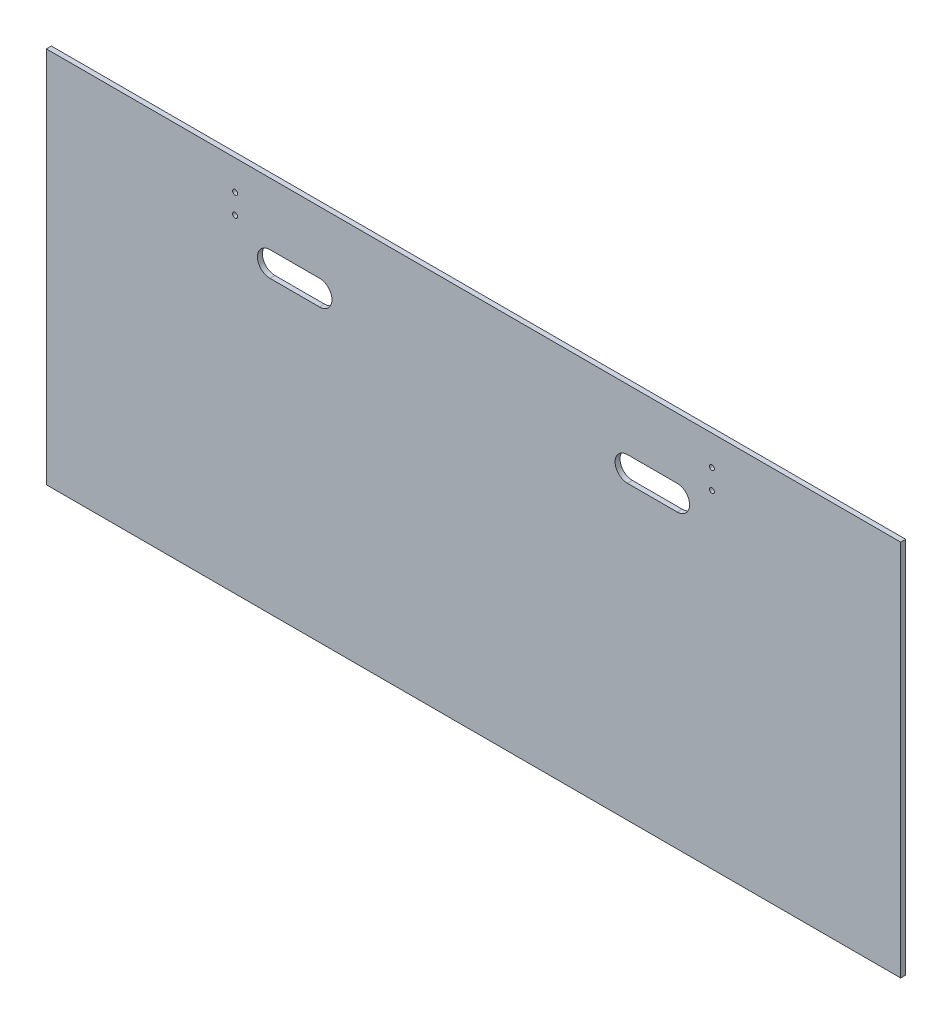
ISO-10303-21;
HEADER;
FILE_DESCRIPTION(('STEP AP214'),'2;1');
FILE_NAME('part.step','',(''),(''),'','','');
FILE_SCHEMA(('AUTOMOTIVE_DESIGN { 1 0 10303 214 1 1 1 1 }'));
ENDSEC;
DATA;
#1=APPLICATION_CONTEXT('core data for automotive mechanical design processes');
#2=APPLICATION_PROTOCOL_DEFINITION('international standard','automotive_design',2000,#1);
#3=PRODUCT_CONTEXT('',#1,'mechanical');
#4=PRODUCT('Part','Part','',(#3));
#5=PRODUCT_RELATED_PRODUCT_CATEGORY('part','',(#4));
#6=PRODUCT_DEFINITION_FORMATION('','',#4);
#7=PRODUCT_DEFINITION_CONTEXT('part definition',#1,'design');
#8=PRODUCT_DEFINITION('design','',#6,#7);
#9=PRODUCT_DEFINITION_SHAPE('','',#8);
#10=(LENGTH_UNIT() NAMED_UNIT(*) SI_UNIT(.MILLI.,.METRE.));
#11=(NAMED_UNIT(*) PLANE_ANGLE_UNIT() SI_UNIT($,.RADIAN.));
#12=(NAMED_UNIT(*) SI_UNIT($,.STERADIAN.) SOLID_ANGLE_UNIT());
#13=UNCERTAINTY_MEASURE_WITH_UNIT(LENGTH_MEASURE(1.E-05),#10,'distance_accuracy_value','');
#14=(GEOMETRIC_REPRESENTATION_CONTEXT(3) GLOBAL_UNCERTAINTY_ASSIGNED_CONTEXT((#13)) GLOBAL_UNIT_ASSIGNED_CONTEXT((#10,
#11,#12)) REPRESENTATION_CONTEXT('',''));
#15=CARTESIAN_POINT('',(0.,0.,0.));
#16=DIRECTION('',(0.,0.,1.));
#17=DIRECTION('',(1.,0.,0.));
#18=AXIS2_PLACEMENT_3D('',#15,#16,#17);
#19=CARTESIAN_POINT('',(415.548348060743,236.932470234911,0.));
#20=DIRECTION('',(0.,0.,1.));
#21=DIRECTION('',(1.,0.,0.));
#22=AXIS2_PLACEMENT_3D('',#19,#20,#21);
#23=PLANE('',#22);
#24=DIRECTION('',(1.,0.,0.));
#25=VECTOR('',#24,1.);
#26=CARTESIAN_POINT('',(612.398348060743,400.444970234912,0.));
#27=LINE('',#26,#25);
#28=CARTESIAN_POINT('',(675.898348060742,400.444970234912,0.));
#29=VERTEX_POINT('',#28);
#30=CARTESIAN_POINT('',(612.398348060743,400.444970234912,0.));
#31=VERTEX_POINT('',#30);
#32=EDGE_CURVE('E136',#29,#31,#27,.F.);
#33=ORIENTED_EDGE('',*,*,#32,.T.);
#34=CARTESIAN_POINT('',(612.398348060743,384.569970234912,0.));
#35=DIRECTION('',(0.,0.,1.));
#36=DIRECTION('',(1.,0.,0.));
#37=AXIS2_PLACEMENT_3D('',#34,#35,#36);
#38=CIRCLE('',#37,15.875);
#39=CARTESIAN_POINT('',(612.398348060743,368.694970234912,0.));
#40=VERTEX_POINT('',#39);
#41=EDGE_CURVE('E171',#31,#40,#38,.T.);
#42=ORIENTED_EDGE('',*,*,#41,.T.);
#43=DIRECTION('',(1.,0.,0.));
#44=VECTOR('',#43,1.);
#45=CARTESIAN_POINT('',(675.898348060742,368.694970234912,0.));
#46=LINE('',#45,#44);
#47=CARTESIAN_POINT('',(675.898348060742,368.694970234912,0.));
#48=VERTEX_POINT('',#47);
#49=EDGE_CURVE('E132',#40,#48,#46,.T.);
#50=ORIENTED_EDGE('',*,*,#49,.T.);
#51=CARTESIAN_POINT('',(675.898348060742,384.569970234912,0.));
#52=DIRECTION('',(0.,0.,1.));
#53=DIRECTION('',(1.,0.,0.));
#54=AXIS2_PLACEMENT_3D('',#51,#52,#53);
#55=CIRCLE('',#54,15.875);
#56=EDGE_CURVE('E138',#48,#29,#55,.T.);
#57=ORIENTED_EDGE('',*,*,#56,.T.);
#58=EDGE_LOOP('',(#33,#42,#50,#57));
#59=FACE_BOUND('',#58,.T.);
#60=DIRECTION('',(1.,0.,0.));
#61=VECTOR('',#60,1.);
#62=CARTESIAN_POINT('',(218.698348060743,367.107470234912,0.));
#63=LINE('',#62,#61);
#64=CARTESIAN_POINT('',(155.198348060743,367.107470234912,0.));
#65=VERTEX_POINT('',#64);
#66=CARTESIAN_POINT('',(218.698348060743,367.107470234912,0.));
#67=VERTEX_POINT('',#66);
#68=EDGE_CURVE('E143',#65,#67,#63,.T.);
#69=ORIENTED_EDGE('',*,*,#68,.T.);
#70=CARTESIAN_POINT('',(218.698348060743,382.982470234912,0.));
#71=DIRECTION('',(0.,0.,1.));
#72=DIRECTION('',(1.,0.,0.));
#73=AXIS2_PLACEMENT_3D('',#70,#71,#72);
#74=CIRCLE('',#73,15.875);
#75=CARTESIAN_POINT('',(218.698348060743,398.857470234912,0.));
#76=VERTEX_POINT('',#75);
#77=EDGE_CURVE('E175',#67,#76,#74,.T.);
#78=ORIENTED_EDGE('',*,*,#77,.T.);
#79=DIRECTION('',(1.,0.,0.));
#80=VECTOR('',#79,1.);
#81=CARTESIAN_POINT('',(155.198348060743,398.857470234912,0.));
#82=LINE('',#81,#80);
#83=CARTESIAN_POINT('',(155.198348060743,398.857470234912,0.));
#84=VERTEX_POINT('',#83);
#85=EDGE_CURVE('E85',#76,#84,#82,.F.);
#86=ORIENTED_EDGE('',*,*,#85,.T.);
#87=CARTESIAN_POINT('',(155.198348060743,382.982470234912,0.));
#88=DIRECTION('',(0.,0.,1.));
#89=DIRECTION('',(1.,0.,0.));
#90=AXIS2_PLACEMENT_3D('',#87,#88,#89);
#91=CIRCLE('',#90,15.875);
#92=EDGE_CURVE('E88',#84,#65,#91,.T.);
#93=ORIENTED_EDGE('',*,*,#92,.T.);
#94=EDGE_LOOP('',(#69,#78,#86,#93));
#95=FACE_BOUND('',#94,.T.);
#96=CARTESIAN_POINT('',(720.348348060743,414.732470234912,0.));
#97=DIRECTION('',(0.,0.,1.));
#98=DIRECTION('',(1.,0.,0.));
#99=AXIS2_PLACEMENT_3D('',#96,#97,#98);
#100=CIRCLE('',#99,3.175);
#101=CARTESIAN_POINT('',(723.523348060743,414.732470234912,0.));
#102=VERTEX_POINT('',#101);
#103=EDGE_CURVE('E144',#102,#102,#100,.T.);
#104=ORIENTED_EDGE('',*,*,#103,.T.);
#105=EDGE_LOOP('',(#104));
#106=FACE_BOUND('',#105,.T.);
#107=CARTESIAN_POINT('',(720.348348060743,440.132470234912,0.));
#108=DIRECTION('',(0.,0.,1.));
#109=DIRECTION('',(1.,0.,0.));
#110=AXIS2_PLACEMENT_3D('',#107,#108,#109);
#111=CIRCLE('',#110,3.175);
#112=CARTESIAN_POINT('',(723.523348060743,440.132470234912,0.));
#113=VERTEX_POINT('',#112);
#114=EDGE_CURVE('E181',#113,#113,#111,.T.);
#115=ORIENTED_EDGE('',*,*,#114,.T.);
#116=EDGE_LOOP('',(#115));
#117=FACE_BOUND('',#116,.T.);
#118=CARTESIAN_POINT('',(110.748348060743,414.732470234912,0.));
#119=DIRECTION('',(0.,0.,1.));
#120=DIRECTION('',(1.,0.,0.));
#121=AXIS2_PLACEMENT_3D('',#118,#119,#120);
#122=CIRCLE('',#121,3.175);
#123=CARTESIAN_POINT('',(113.923348060743,414.732470234912,0.));
#124=VERTEX_POINT('',#123);
#125=EDGE_CURVE('E183',#124,#124,#122,.T.);
#126=ORIENTED_EDGE('',*,*,#125,.T.);
#127=EDGE_LOOP('',(#126));
#128=FACE_BOUND('',#127,.T.);
#129=CARTESIAN_POINT('',(110.748348060743,440.132470234912,0.));
#130=DIRECTION('',(0.,0.,1.));
#131=DIRECTION('',(1.,0.,0.));
#132=AXIS2_PLACEMENT_3D('',#129,#130,#131);
#133=CIRCLE('',#132,3.175);
#134=CARTESIAN_POINT('',(113.923348060743,440.132470234912,0.));
#135=VERTEX_POINT('',#134);
#136=EDGE_CURVE('E20',#135,#135,#133,.T.);
#137=ORIENTED_EDGE('',*,*,#136,.T.);
#138=EDGE_LOOP('',(#137));
#139=FACE_BOUND('',#138,.T.);
#140=DIRECTION('',(1.,0.,0.));
#141=VECTOR('',#140,1.);
#142=CARTESIAN_POINT('',(-130.551651939257,478.232470234912,0.));
#143=LINE('',#142,#141);
#144=CARTESIAN_POINT('',(961.648348060742,478.232470234912,0.));
#145=VERTEX_POINT('',#144);
#146=CARTESIAN_POINT('',(-130.551651939257,478.232470234912,0.));
#147=VERTEX_POINT('',#146);
#148=EDGE_CURVE('E106',#145,#147,#143,.F.);
#149=ORIENTED_EDGE('',*,*,#148,.F.);
#150=DIRECTION('',(0.,1.,0.));
#151=VECTOR('',#150,1.);
#152=CARTESIAN_POINT('',(961.648348060742,478.232470234912,0.));
#153=LINE('',#152,#151);
#154=CARTESIAN_POINT('',(961.648348060742,-4.36752976508855,0.));
#155=VERTEX_POINT('',#154);
#156=EDGE_CURVE('E97',#155,#145,#153,.T.);
#157=ORIENTED_EDGE('',*,*,#156,.F.);
#158=DIRECTION('',(1.,0.,0.));
#159=VECTOR('',#158,1.);
#160=CARTESIAN_POINT('',(961.648348060742,-4.36752976508856,0.));
#161=LINE('',#160,#159);
#162=CARTESIAN_POINT('',(-130.551651939257,-4.36752976508856,0.));
#163=VERTEX_POINT('',#162);
#164=EDGE_CURVE('E196',#163,#155,#161,.T.);
#165=ORIENTED_EDGE('',*,*,#164,.F.);
#166=DIRECTION('',(0.,1.,0.));
#167=VECTOR('',#166,1.);
#168=CARTESIAN_POINT('',(-130.551651939257,-4.36752976508856,0.));
#169=LINE('',#168,#167);
#170=EDGE_CURVE('E104',#147,#163,#169,.F.);
#171=ORIENTED_EDGE('',*,*,#170,.F.);
#172=EDGE_LOOP('',(#149,#157,#165,#171));
#173=FACE_BOUND('',#172,.T.);
#174=ADVANCED_FACE('F17',(#59,#95,#106,#117,#128,#139,#173),#23,.F.);
#175=CARTESIAN_POINT('',(961.648348060742,478.232470234912,0.));
#176=DIRECTION('',(1.,0.,0.));
#177=DIRECTION('',(0.,0.,-1.));
#178=AXIS2_PLACEMENT_3D('',#175,#176,#177);
#179=PLANE('',#178);
#180=DIRECTION('',(0.,1.,0.));
#181=VECTOR('',#180,1.);
#182=CARTESIAN_POINT('',(961.648348060742,236.932470234911,6.35));
#183=LINE('',#182,#181);
#184=CARTESIAN_POINT('',(961.648348060742,-4.36752976508854,6.35));
#185=VERTEX_POINT('',#184);
#186=CARTESIAN_POINT('',(961.648348060742,478.232470234912,6.35));
#187=VERTEX_POINT('',#186);
#188=EDGE_CURVE('E210',#185,#187,#183,.T.);
#189=ORIENTED_EDGE('',*,*,#188,.F.);
#190=DIRECTION('',(0.,0.,-1.));
#191=VECTOR('',#190,1.);
#192=CARTESIAN_POINT('',(961.648348060742,-4.36752976508856,0.));
#193=LINE('',#192,#191);
#194=EDGE_CURVE('E120',#155,#185,#193,.F.);
#195=ORIENTED_EDGE('',*,*,#194,.F.);
#196=ORIENTED_EDGE('',*,*,#156,.T.);
#197=DIRECTION('',(0.,0.,1.));
#198=VECTOR('',#197,1.);
#199=CARTESIAN_POINT('',(961.648348060742,478.232470234912,0.));
#200=LINE('',#199,#198);
#201=EDGE_CURVE('E111',#187,#145,#200,.F.);
#202=ORIENTED_EDGE('',*,*,#201,.F.);
#203=EDGE_LOOP('',(#189,#195,#196,#202));
#204=FACE_BOUND('',#203,.T.);
#205=ADVANCED_FACE('F116',(#204),#179,.T.);
#206=CARTESIAN_POINT('',(-130.551651939257,478.232470234912,0.));
#207=DIRECTION('',(0.,1.,0.));
#208=DIRECTION('',(0.,0.,1.));
#209=AXIS2_PLACEMENT_3D('',#206,#207,#208);
#210=PLANE('',#209);
#211=DIRECTION('',(1.,0.,0.));
#212=VECTOR('',#211,1.);
#213=CARTESIAN_POINT('',(415.548348060743,478.232470234912,6.35));
#214=LINE('',#213,#212);
#215=CARTESIAN_POINT('',(-130.551651939257,478.232470234912,6.35));
#216=VERTEX_POINT('',#215);
#217=EDGE_CURVE('E125',#187,#216,#214,.F.);
#218=ORIENTED_EDGE('',*,*,#217,.F.);
#219=ORIENTED_EDGE('',*,*,#201,.T.);
#220=ORIENTED_EDGE('',*,*,#148,.T.);
#221=DIRECTION('',(0.,0.,1.));
#222=VECTOR('',#221,1.);
#223=CARTESIAN_POINT('',(-130.551651939257,478.232470234912,0.));
#224=LINE('',#223,#222);
#225=EDGE_CURVE('E128',#216,#147,#224,.F.);
#226=ORIENTED_EDGE('',*,*,#225,.F.);
#227=EDGE_LOOP('',(#218,#219,#220,#226));
#228=FACE_BOUND('',#227,.T.);
#229=ADVANCED_FACE('F123',(#228),#210,.T.);
#230=CARTESIAN_POINT('',(-130.551651939257,-4.36752976508856,0.));
#231=DIRECTION('',(-1.,0.,0.));
#232=DIRECTION('',(0.,0.,1.));
#233=AXIS2_PLACEMENT_3D('',#230,#231,#232);
#234=PLANE('',#233);
#235=DIRECTION('',(0.,1.,0.));
#236=VECTOR('',#235,1.);
#237=CARTESIAN_POINT('',(-130.551651939257,236.932470234911,6.35));
#238=LINE('',#237,#236);
#239=CARTESIAN_POINT('',(-130.551651939257,-4.36752976508856,6.35));
#240=VERTEX_POINT('',#239);
#241=EDGE_CURVE('E206',#216,#240,#238,.F.);
#242=ORIENTED_EDGE('',*,*,#241,.F.);
#243=ORIENTED_EDGE('',*,*,#225,.T.);
#244=ORIENTED_EDGE('',*,*,#170,.T.);
#245=DIRECTION('',(0.,0.,-1.));
#246=VECTOR('',#245,1.);
#247=CARTESIAN_POINT('',(-130.551651939257,-4.36752976508856,0.));
#248=LINE('',#247,#246);
#249=EDGE_CURVE('E188',#240,#163,#248,.T.);
#250=ORIENTED_EDGE('',*,*,#249,.F.);
#251=EDGE_LOOP('',(#242,#243,#244,#250));
#252=FACE_BOUND('',#251,.T.);
#253=ADVANCED_FACE('F203',(#252),#234,.T.);
#254=CARTESIAN_POINT('',(961.648348060742,-4.36752976508856,0.));
#255=DIRECTION('',(0.,-1.,0.));
#256=DIRECTION('',(0.,0.,-1.));
#257=AXIS2_PLACEMENT_3D('',#254,#255,#256);
#258=PLANE('',#257);
#259=DIRECTION('',(1.,0.,0.));
#260=VECTOR('',#259,1.);
#261=CARTESIAN_POINT('',(415.548348060743,-4.36752976508856,6.35));
#262=LINE('',#261,#260);
#263=EDGE_CURVE('E170',#240,#185,#262,.T.);
#264=ORIENTED_EDGE('',*,*,#263,.F.);
#265=ORIENTED_EDGE('',*,*,#249,.T.);
#266=ORIENTED_EDGE('',*,*,#164,.T.);
#267=ORIENTED_EDGE('',*,*,#194,.T.);
#268=EDGE_LOOP('',(#264,#265,#266,#267));
#269=FACE_BOUND('',#268,.T.);
#270=ADVANCED_FACE('F214',(#269),#258,.T.);
#271=CARTESIAN_POINT('',(110.748348060743,440.132470234912,0.));
#272=DIRECTION('',(0.,0.,1.));
#273=DIRECTION('',(1.,0.,0.));
#274=AXIS2_PLACEMENT_3D('',#271,#272,#273);
#275=CYLINDRICAL_SURFACE('',#274,3.175);
#276=CARTESIAN_POINT('',(110.748348060743,440.132470234912,6.35));
#277=DIRECTION('',(0.,0.,1.));
#278=DIRECTION('',(1.,0.,0.));
#279=AXIS2_PLACEMENT_3D('',#276,#277,#278);
#280=CIRCLE('',#279,3.175);
#281=CARTESIAN_POINT('',(113.923348060743,440.132470234912,6.35));
#282=VERTEX_POINT('',#281);
#283=EDGE_CURVE('E167',#282,#282,#280,.F.);
#284=ORIENTED_EDGE('',*,*,#283,.F.);
#285=EDGE_LOOP('',(#284));
#286=FACE_BOUND('',#285,.T.);
#287=ORIENTED_EDGE('',*,*,#136,.F.);
#288=EDGE_LOOP('',(#287));
#289=FACE_BOUND('',#288,.T.);
#290=ADVANCED_FACE('F269',(#286,#289),#275,.F.);
#291=CARTESIAN_POINT('',(110.748348060743,414.732470234912,0.));
#292=DIRECTION('',(0.,0.,1.));
#293=DIRECTION('',(1.,0.,0.));
#294=AXIS2_PLACEMENT_3D('',#291,#292,#293);
#295=CYLINDRICAL_SURFACE('',#294,3.175);
#296=CARTESIAN_POINT('',(110.748348060743,414.732470234912,6.35));
#297=DIRECTION('',(0.,0.,1.));
#298=DIRECTION('',(1.,0.,0.));
#299=AXIS2_PLACEMENT_3D('',#296,#297,#298);
#300=CIRCLE('',#299,3.175);
#301=CARTESIAN_POINT('',(113.923348060743,414.732470234912,6.35));
#302=VERTEX_POINT('',#301);
#303=EDGE_CURVE('E164',#302,#302,#300,.F.);
#304=ORIENTED_EDGE('',*,*,#303,.F.);
#305=EDGE_LOOP('',(#304));
#306=FACE_BOUND('',#305,.T.);
#307=ORIENTED_EDGE('',*,*,#125,.F.);
#308=EDGE_LOOP('',(#307));
#309=FACE_BOUND('',#308,.T.);
#310=ADVANCED_FACE('F259',(#306,#309),#295,.F.);
#311=CARTESIAN_POINT('',(720.348348060743,440.132470234912,0.));
#312=DIRECTION('',(0.,0.,1.));
#313=DIRECTION('',(1.,0.,0.));
#314=AXIS2_PLACEMENT_3D('',#311,#312,#313);
#315=CYLINDRICAL_SURFACE('',#314,3.175);
#316=CARTESIAN_POINT('',(720.348348060743,440.132470234912,6.35));
#317=DIRECTION('',(0.,0.,1.));
#318=DIRECTION('',(1.,0.,0.));
#319=AXIS2_PLACEMENT_3D('',#316,#317,#318);
#320=CIRCLE('',#319,3.175);
#321=CARTESIAN_POINT('',(723.523348060743,440.132470234912,6.35));
#322=VERTEX_POINT('',#321);
#323=EDGE_CURVE('E161',#322,#322,#320,.F.);
#324=ORIENTED_EDGE('',*,*,#323,.F.);
#325=EDGE_LOOP('',(#324));
#326=FACE_BOUND('',#325,.T.);
#327=ORIENTED_EDGE('',*,*,#114,.F.);
#328=EDGE_LOOP('',(#327));
#329=FACE_BOUND('',#328,.T.);
#330=ADVANCED_FACE('F256',(#326,#329),#315,.F.);
#331=CARTESIAN_POINT('',(720.348348060743,414.732470234912,0.));
#332=DIRECTION('',(0.,0.,1.));
#333=DIRECTION('',(1.,0.,0.));
#334=AXIS2_PLACEMENT_3D('',#331,#332,#333);
#335=CYLINDRICAL_SURFACE('',#334,3.175);
#336=CARTESIAN_POINT('',(720.348348060743,414.732470234912,6.35));
#337=DIRECTION('',(0.,0.,1.));
#338=DIRECTION('',(1.,0.,0.));
#339=AXIS2_PLACEMENT_3D('',#336,#337,#338);
#340=CIRCLE('',#339,3.175);
#341=CARTESIAN_POINT('',(723.523348060743,414.732470234912,6.35));
#342=VERTEX_POINT('',#341);
#343=EDGE_CURVE('E158',#342,#342,#340,.F.);
#344=ORIENTED_EDGE('',*,*,#343,.F.);
#345=EDGE_LOOP('',(#344));
#346=FACE_BOUND('',#345,.T.);
#347=ORIENTED_EDGE('',*,*,#103,.F.);
#348=EDGE_LOOP('',(#347));
#349=FACE_BOUND('',#348,.T.);
#350=ADVANCED_FACE('F258',(#346,#349),#335,.F.);
#351=CARTESIAN_POINT('',(218.698348060743,367.107470234912,0.));
#352=DIRECTION('',(0.,-1.,0.));
#353=DIRECTION('',(0.,0.,-1.));
#354=AXIS2_PLACEMENT_3D('',#351,#352,#353);
#355=PLANE('',#354);
#356=ORIENTED_EDGE('',*,*,#68,.F.);
#357=DIRECTION('',(0.,0.,1.));
#358=VECTOR('',#357,1.);
#359=CARTESIAN_POINT('',(155.198348060743,367.107470234912,0.));
#360=LINE('',#359,#358);
#361=CARTESIAN_POINT('',(155.198348060743,367.107470234912,6.35));
#362=VERTEX_POINT('',#361);
#363=EDGE_CURVE('E142',#65,#362,#360,.T.);
#364=ORIENTED_EDGE('',*,*,#363,.T.);
#365=DIRECTION('',(1.,0.,0.));
#366=VECTOR('',#365,1.);
#367=CARTESIAN_POINT('',(415.548348060743,367.107470234912,6.35));
#368=LINE('',#367,#366);
#369=CARTESIAN_POINT('',(218.698348060743,367.107470234912,6.35));
#370=VERTEX_POINT('',#369);
#371=EDGE_CURVE('E157',#370,#362,#368,.F.);
#372=ORIENTED_EDGE('',*,*,#371,.F.);
#373=DIRECTION('',(0.,0.,1.));
#374=VECTOR('',#373,1.);
#375=CARTESIAN_POINT('',(218.698348060743,367.107470234912,0.));
#376=LINE('',#375,#374);
#377=EDGE_CURVE('E177',#370,#67,#376,.F.);
#378=ORIENTED_EDGE('',*,*,#377,.T.);
#379=EDGE_LOOP('',(#356,#364,#372,#378));
#380=FACE_BOUND('',#379,.T.);
#381=ADVANCED_FACE('F245',(#380),#355,.F.);
#382=CARTESIAN_POINT('',(155.198348060743,382.982470234912,0.));
#383=DIRECTION('',(0.,0.,1.));
#384=DIRECTION('',(1.,0.,0.));
#385=AXIS2_PLACEMENT_3D('',#382,#383,#384);
#386=CYLINDRICAL_SURFACE('',#385,15.875);
#387=ORIENTED_EDGE('',*,*,#92,.F.);
#388=DIRECTION('',(0.,0.,1.));
#389=VECTOR('',#388,1.);
#390=CARTESIAN_POINT('',(155.198348060743,398.857470234912,0.));
#391=LINE('',#390,#389);
#392=CARTESIAN_POINT('',(155.198348060743,398.857470234912,6.35));
#393=VERTEX_POINT('',#392);
#394=EDGE_CURVE('E141',#84,#393,#391,.T.);
#395=ORIENTED_EDGE('',*,*,#394,.T.);
#396=CARTESIAN_POINT('',(155.198348060743,382.982470234912,6.35));
#397=DIRECTION('',(0.,0.,1.));
#398=DIRECTION('',(1.,0.,0.));
#399=AXIS2_PLACEMENT_3D('',#396,#397,#398);
#400=CIRCLE('',#399,15.875);
#401=EDGE_CURVE('E154',#362,#393,#400,.F.);
#402=ORIENTED_EDGE('',*,*,#401,.F.);
#403=ORIENTED_EDGE('',*,*,#363,.F.);
#404=EDGE_LOOP('',(#387,#395,#402,#403));
#405=FACE_BOUND('',#404,.T.);
#406=ADVANCED_FACE('F233',(#405),#386,.F.);
#407=CARTESIAN_POINT('',(155.198348060743,398.857470234912,0.));
#408=DIRECTION('',(0.,1.,0.));
#409=DIRECTION('',(0.,0.,1.));
#410=AXIS2_PLACEMENT_3D('',#407,#408,#409);
#411=PLANE('',#410);
#412=ORIENTED_EDGE('',*,*,#85,.F.);
#413=DIRECTION('',(0.,0.,1.));
#414=VECTOR('',#413,1.);
#415=CARTESIAN_POINT('',(218.698348060743,398.857470234912,0.));
#416=LINE('',#415,#414);
#417=CARTESIAN_POINT('',(218.698348060743,398.857470234912,6.35));
#418=VERTEX_POINT('',#417);
#419=EDGE_CURVE('E139',#76,#418,#416,.T.);
#420=ORIENTED_EDGE('',*,*,#419,.T.);
#421=DIRECTION('',(1.,0.,0.));
#422=VECTOR('',#421,1.);
#423=CARTESIAN_POINT('',(415.548348060743,398.857470234912,6.35));
#424=LINE('',#423,#422);
#425=EDGE_CURVE('E153',#393,#418,#424,.T.);
#426=ORIENTED_EDGE('',*,*,#425,.F.);
#427=ORIENTED_EDGE('',*,*,#394,.F.);
#428=EDGE_LOOP('',(#412,#420,#426,#427));
#429=FACE_BOUND('',#428,.T.);
#430=ADVANCED_FACE('F238',(#429),#411,.F.);
#431=CARTESIAN_POINT('',(218.698348060743,382.982470234912,0.));
#432=DIRECTION('',(0.,0.,1.));
#433=DIRECTION('',(1.,0.,0.));
#434=AXIS2_PLACEMENT_3D('',#431,#432,#433);
#435=CYLINDRICAL_SURFACE('',#434,15.875);
#436=ORIENTED_EDGE('',*,*,#77,.F.);
#437=ORIENTED_EDGE('',*,*,#377,.F.);
#438=CARTESIAN_POINT('',(218.698348060743,382.982470234912,6.35));
#439=DIRECTION('',(0.,0.,1.));
#440=DIRECTION('',(1.,0.,0.));
#441=AXIS2_PLACEMENT_3D('',#438,#439,#440);
#442=CIRCLE('',#441,15.875);
#443=EDGE_CURVE('E150',#418,#370,#442,.F.);
#444=ORIENTED_EDGE('',*,*,#443,.F.);
#445=ORIENTED_EDGE('',*,*,#419,.F.);
#446=EDGE_LOOP('',(#436,#437,#444,#445));
#447=FACE_BOUND('',#446,.T.);
#448=ADVANCED_FACE('F248',(#447),#435,.F.);
#449=CARTESIAN_POINT('',(612.398348060743,400.444970234912,0.));
#450=DIRECTION('',(0.,1.,0.));
#451=DIRECTION('',(0.,0.,1.));
#452=AXIS2_PLACEMENT_3D('',#449,#450,#451);
#453=PLANE('',#452);
#454=ORIENTED_EDGE('',*,*,#32,.F.);
#455=DIRECTION('',(0.,0.,1.));
#456=VECTOR('',#455,1.);
#457=CARTESIAN_POINT('',(675.898348060742,400.444970234912,0.));
#458=LINE('',#457,#456);
#459=CARTESIAN_POINT('',(675.898348060742,400.444970234912,6.35));
#460=VERTEX_POINT('',#459);
#461=EDGE_CURVE('E135',#29,#460,#458,.T.);
#462=ORIENTED_EDGE('',*,*,#461,.T.);
#463=DIRECTION('',(1.,0.,0.));
#464=VECTOR('',#463,1.);
#465=CARTESIAN_POINT('',(415.548348060743,400.444970234912,6.35));
#466=LINE('',#465,#464);
#467=CARTESIAN_POINT('',(612.398348060743,400.444970234912,6.35));
#468=VERTEX_POINT('',#467);
#469=EDGE_CURVE('E149',#468,#460,#466,.T.);
#470=ORIENTED_EDGE('',*,*,#469,.F.);
#471=DIRECTION('',(0.,0.,1.));
#472=VECTOR('',#471,1.);
#473=CARTESIAN_POINT('',(612.398348060743,400.444970234912,0.));
#474=LINE('',#473,#472);
#475=EDGE_CURVE('E173',#468,#31,#474,.F.);
#476=ORIENTED_EDGE('',*,*,#475,.T.);
#477=EDGE_LOOP('',(#454,#462,#470,#476));
#478=FACE_BOUND('',#477,.T.);
#479=ADVANCED_FACE('F290',(#478),#453,.F.);
#480=CARTESIAN_POINT('',(675.898348060742,384.569970234912,0.));
#481=DIRECTION('',(0.,0.,1.));
#482=DIRECTION('',(1.,0.,0.));
#483=AXIS2_PLACEMENT_3D('',#480,#481,#482);
#484=CYLINDRICAL_SURFACE('',#483,15.875);
#485=ORIENTED_EDGE('',*,*,#56,.F.);
#486=DIRECTION('',(0.,0.,-1.));
#487=VECTOR('',#486,1.);
#488=CARTESIAN_POINT('',(675.898348060742,368.694970234912,0.));
#489=LINE('',#488,#487);
#490=CARTESIAN_POINT('',(675.898348060742,368.694970234912,6.35));
#491=VERTEX_POINT('',#490);
#492=EDGE_CURVE('E134',#48,#491,#489,.F.);
#493=ORIENTED_EDGE('',*,*,#492,.T.);
#494=CARTESIAN_POINT('',(675.898348060742,384.569970234912,6.35));
#495=DIRECTION('',(0.,0.,1.));
#496=DIRECTION('',(1.,0.,0.));
#497=AXIS2_PLACEMENT_3D('',#494,#495,#496);
#498=CIRCLE('',#497,15.875);
#499=EDGE_CURVE('E146',#460,#491,#498,.F.);
#500=ORIENTED_EDGE('',*,*,#499,.F.);
#501=ORIENTED_EDGE('',*,*,#461,.F.);
#502=EDGE_LOOP('',(#485,#493,#500,#501));
#503=FACE_BOUND('',#502,.T.);
#504=ADVANCED_FACE('F287',(#503),#484,.F.);
#505=CARTESIAN_POINT('',(675.898348060742,368.694970234912,0.));
#506=DIRECTION('',(0.,-1.,0.));
#507=DIRECTION('',(0.,0.,-1.));
#508=AXIS2_PLACEMENT_3D('',#505,#506,#507);
#509=PLANE('',#508);
#510=ORIENTED_EDGE('',*,*,#49,.F.);
#511=DIRECTION('',(0.,0.,1.));
#512=VECTOR('',#511,1.);
#513=CARTESIAN_POINT('',(612.398348060743,368.694970234912,0.));
#514=LINE('',#513,#512);
#515=CARTESIAN_POINT('',(612.398348060743,368.694970234912,6.35));
#516=VERTEX_POINT('',#515);
#517=EDGE_CURVE('E35',#40,#516,#514,.T.);
#518=ORIENTED_EDGE('',*,*,#517,.T.);
#519=DIRECTION('',(1.,0.,0.));
#520=VECTOR('',#519,1.);
#521=CARTESIAN_POINT('',(415.548348060743,368.694970234912,6.35));
#522=LINE('',#521,#520);
#523=EDGE_CURVE('E26',#491,#516,#522,.F.);
#524=ORIENTED_EDGE('',*,*,#523,.F.);
#525=ORIENTED_EDGE('',*,*,#492,.F.);
#526=EDGE_LOOP('',(#510,#518,#524,#525));
#527=FACE_BOUND('',#526,.T.);
#528=ADVANCED_FACE('F280',(#527),#509,.F.);
#529=CARTESIAN_POINT('',(612.398348060743,384.569970234912,0.));
#530=DIRECTION('',(0.,0.,1.));
#531=DIRECTION('',(1.,0.,0.));
#532=AXIS2_PLACEMENT_3D('',#529,#530,#531);
#533=CYLINDRICAL_SURFACE('',#532,15.875);
#534=ORIENTED_EDGE('',*,*,#41,.F.);
#535=ORIENTED_EDGE('',*,*,#475,.F.);
#536=CARTESIAN_POINT('',(612.398348060743,384.569970234912,6.35));
#537=DIRECTION('',(0.,0.,1.));
#538=DIRECTION('',(1.,0.,0.));
#539=AXIS2_PLACEMENT_3D('',#536,#537,#538);
#540=CIRCLE('',#539,15.875);
#541=EDGE_CURVE('E11',#516,#468,#540,.F.);
#542=ORIENTED_EDGE('',*,*,#541,.F.);
#543=ORIENTED_EDGE('',*,*,#517,.F.);
#544=EDGE_LOOP('',(#534,#535,#542,#543));
#545=FACE_BOUND('',#544,.T.);
#546=ADVANCED_FACE('F274',(#545),#533,.F.);
#547=CARTESIAN_POINT('',(415.548348060743,236.932470234911,6.35));
#548=DIRECTION('',(0.,0.,1.));
#549=DIRECTION('',(1.,0.,0.));
#550=AXIS2_PLACEMENT_3D('',#547,#548,#549);
#551=PLANE('',#550);
#552=ORIENTED_EDGE('',*,*,#523,.T.);
#553=ORIENTED_EDGE('',*,*,#541,.T.);
#554=ORIENTED_EDGE('',*,*,#469,.T.);
#555=ORIENTED_EDGE('',*,*,#499,.T.);
#556=EDGE_LOOP('',(#552,#553,#554,#555));
#557=FACE_BOUND('',#556,.T.);
#558=ORIENTED_EDGE('',*,*,#425,.T.);
#559=ORIENTED_EDGE('',*,*,#443,.T.);
#560=ORIENTED_EDGE('',*,*,#371,.T.);
#561=ORIENTED_EDGE('',*,*,#401,.T.);
#562=EDGE_LOOP('',(#558,#559,#560,#561));
#563=FACE_BOUND('',#562,.T.);
#564=ORIENTED_EDGE('',*,*,#343,.T.);
#565=EDGE_LOOP('',(#564));
#566=FACE_BOUND('',#565,.T.);
#567=ORIENTED_EDGE('',*,*,#323,.T.);
#568=EDGE_LOOP('',(#567));
#569=FACE_BOUND('',#568,.T.);
#570=ORIENTED_EDGE('',*,*,#303,.T.);
#571=EDGE_LOOP('',(#570));
#572=FACE_BOUND('',#571,.T.);
#573=ORIENTED_EDGE('',*,*,#283,.T.);
#574=EDGE_LOOP('',(#573));
#575=FACE_BOUND('',#574,.T.);
#576=ORIENTED_EDGE('',*,*,#241,.T.);
#577=ORIENTED_EDGE('',*,*,#263,.T.);
#578=ORIENTED_EDGE('',*,*,#188,.T.);
#579=ORIENTED_EDGE('',*,*,#217,.T.);
#580=EDGE_LOOP('',(#576,#577,#578,#579));
#581=FACE_BOUND('',#580,.T.);
#582=ADVANCED_FACE('F215',(#557,#563,#566,#569,#572,#575,#581),#551,.T.);
#583=CLOSED_SHELL('',(#174,#205,#229,#253,#270,#290,#310,#330,#350,#381,#406,#430,#448,#479,
#504,#528,#546,#582));
#584=MANIFOLD_SOLID_BREP('B1',#583);
#585=ADVANCED_BREP_SHAPE_REPRESENTATION('',(#18,#584),#14);
#586=SHAPE_DEFINITION_REPRESENTATION(#9,#585);
ENDSEC;
END-ISO-10303-21;
